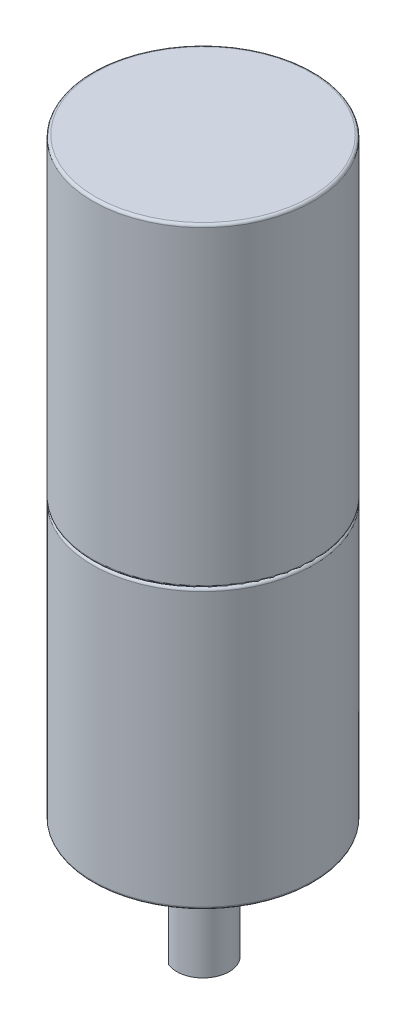
ISO-10303-21;
HEADER;
FILE_DESCRIPTION(('STEP AP214'),'2;1');
FILE_NAME('part.step','',(''),(''),'','','');
FILE_SCHEMA(('AUTOMOTIVE_DESIGN { 1 0 10303 214 1 1 1 1 }'));
ENDSEC;
DATA;
#1=APPLICATION_CONTEXT('core data for automotive mechanical design processes');
#2=APPLICATION_PROTOCOL_DEFINITION('international standard','automotive_design',2000,#1);
#3=PRODUCT_CONTEXT('',#1,'mechanical');
#4=PRODUCT('Part','Part','',(#3));
#5=PRODUCT_RELATED_PRODUCT_CATEGORY('part','',(#4));
#6=PRODUCT_DEFINITION_FORMATION('','',#4);
#7=PRODUCT_DEFINITION_CONTEXT('part definition',#1,'design');
#8=PRODUCT_DEFINITION('design','',#6,#7);
#9=PRODUCT_DEFINITION_SHAPE('','',#8);
#10=(LENGTH_UNIT() NAMED_UNIT(*) SI_UNIT(.MILLI.,.METRE.));
#11=(NAMED_UNIT(*) PLANE_ANGLE_UNIT() SI_UNIT($,.RADIAN.));
#12=(NAMED_UNIT(*) SI_UNIT($,.STERADIAN.) SOLID_ANGLE_UNIT());
#13=UNCERTAINTY_MEASURE_WITH_UNIT(LENGTH_MEASURE(1.E-05),#10,'distance_accuracy_value','');
#14=(GEOMETRIC_REPRESENTATION_CONTEXT(3) GLOBAL_UNCERTAINTY_ASSIGNED_CONTEXT((#13)) GLOBAL_UNIT_ASSIGNED_CONTEXT((#10,
#11,#12)) REPRESENTATION_CONTEXT('',''));
#15=CARTESIAN_POINT('',(0.,0.,0.));
#16=DIRECTION('',(0.,0.,1.));
#17=DIRECTION('',(1.,0.,0.));
#18=AXIS2_PLACEMENT_3D('',#15,#16,#17);
#19=CARTESIAN_POINT('',(0.,-53.,0.));
#20=DIRECTION('',(0.,-1.,0.));
#21=DIRECTION('',(0.,0.,-1.));
#22=AXIS2_PLACEMENT_3D('',#19,#20,#21);
#23=PLANE('',#22);
#24=CARTESIAN_POINT('',(-17.5,-53.,0.));
#25=DIRECTION('',(0.,-1.,0.));
#26=DIRECTION('',(0.,0.,-1.));
#27=AXIS2_PLACEMENT_3D('',#24,#25,#26);
#28=CIRCLE('',#27,2.);
#29=CARTESIAN_POINT('',(-17.5,-53.,-2.));
#30=VERTEX_POINT('',#29);
#31=EDGE_CURVE('E386',#30,#30,#28,.T.);
#32=ORIENTED_EDGE('',*,*,#31,.F.);
#33=EDGE_LOOP('',(#32));
#34=FACE_BOUND('',#33,.T.);
#35=CARTESIAN_POINT('',(0.,-53.,17.5));
#36=DIRECTION('',(0.,-1.,0.));
#37=DIRECTION('',(0.,0.,-1.));
#38=AXIS2_PLACEMENT_3D('',#35,#36,#37);
#39=CIRCLE('',#38,2.);
#40=CARTESIAN_POINT('',(0.,-53.,15.5));
#41=VERTEX_POINT('',#40);
#42=EDGE_CURVE('E394',#41,#41,#39,.T.);
#43=ORIENTED_EDGE('',*,*,#42,.F.);
#44=EDGE_LOOP('',(#43));
#45=FACE_BOUND('',#44,.T.);
#46=CARTESIAN_POINT('',(17.5,-53.,0.));
#47=DIRECTION('',(0.,-1.,0.));
#48=DIRECTION('',(0.,0.,-1.));
#49=AXIS2_PLACEMENT_3D('',#46,#47,#48);
#50=CIRCLE('',#49,2.);
#51=CARTESIAN_POINT('',(17.5,-53.,-2.));
#52=VERTEX_POINT('',#51);
#53=EDGE_CURVE('E400',#52,#52,#50,.T.);
#54=ORIENTED_EDGE('',*,*,#53,.F.);
#55=EDGE_LOOP('',(#54));
#56=FACE_BOUND('',#55,.T.);
#57=CARTESIAN_POINT('',(0.,-53.,-17.5));
#58=DIRECTION('',(0.,-1.,0.));
#59=DIRECTION('',(0.,0.,-1.));
#60=AXIS2_PLACEMENT_3D('',#57,#58,#59);
#61=CIRCLE('',#60,2.);
#62=CARTESIAN_POINT('',(0.,-53.,-19.5));
#63=VERTEX_POINT('',#62);
#64=EDGE_CURVE('E406',#63,#63,#61,.T.);
#65=ORIENTED_EDGE('',*,*,#64,.F.);
#66=EDGE_LOOP('',(#65));
#67=FACE_BOUND('',#66,.T.);
#68=CARTESIAN_POINT('',(0.,-53.,0.));
#69=DIRECTION('',(0.,-1.,0.));
#70=DIRECTION('',(0.,0.,-1.));
#71=AXIS2_PLACEMENT_3D('',#68,#69,#70);
#72=CIRCLE('',#71,20.5);
#73=CARTESIAN_POINT('',(0.,-53.,-20.5));
#74=VERTEX_POINT('',#73);
#75=EDGE_CURVE('E155',#74,#74,#72,.T.);
#76=ORIENTED_EDGE('',*,*,#75,.T.);
#77=EDGE_LOOP('',(#76));
#78=FACE_BOUND('',#77,.T.);
#79=DIRECTION('',(0.,0.,1.));
#80=VECTOR('',#79,1.);
#81=CARTESIAN_POINT('',(11.5,-53.,-4.89897948556636));
#82=LINE('',#81,#80);
#83=CARTESIAN_POINT('',(11.5,-53.,-4.89897948556636));
#84=VERTEX_POINT('',#83);
#85=CARTESIAN_POINT('',(11.5,-53.,4.89897948556636));
#86=VERTEX_POINT('',#85);
#87=EDGE_CURVE('E130',#84,#86,#82,.T.);
#88=ORIENTED_EDGE('',*,*,#87,.F.);
#89=CARTESIAN_POINT('',(0.,-53.,0.));
#90=DIRECTION('',(0.,-1.,0.));
#91=DIRECTION('',(0.,0.,-1.));
#92=AXIS2_PLACEMENT_3D('',#89,#90,#91);
#93=CIRCLE('',#92,12.5);
#94=CARTESIAN_POINT('',(-11.5,-53.,-4.89897948556636));
#95=VERTEX_POINT('',#94);
#96=EDGE_CURVE('E115',#95,#84,#93,.T.);
#97=ORIENTED_EDGE('',*,*,#96,.F.);
#98=DIRECTION('',(0.,0.,-1.));
#99=VECTOR('',#98,1.);
#100=CARTESIAN_POINT('',(-11.5,-53.,-4.89897948556636));
#101=LINE('',#100,#99);
#102=CARTESIAN_POINT('',(-11.5,-53.,4.89897948556636));
#103=VERTEX_POINT('',#102);
#104=EDGE_CURVE('E121',#103,#95,#101,.T.);
#105=ORIENTED_EDGE('',*,*,#104,.F.);
#106=CARTESIAN_POINT('',(0.,-53.,0.));
#107=DIRECTION('',(0.,-1.,0.));
#108=DIRECTION('',(0.,0.,-1.));
#109=AXIS2_PLACEMENT_3D('',#106,#107,#108);
#110=CIRCLE('',#109,12.5);
#111=EDGE_CURVE('E132',#86,#103,#110,.T.);
#112=ORIENTED_EDGE('',*,*,#111,.F.);
#113=EDGE_LOOP('',(#88,#97,#105,#112));
#114=FACE_BOUND('',#113,.T.);
#115=ADVANCED_FACE('F40',(#34,#45,#56,#67,#78,#114),#23,.T.);
#116=CARTESIAN_POINT('',(0.,60.,0.));
#117=DIRECTION('',(0.,-1.,0.));
#118=DIRECTION('',(0.,0.,-1.));
#119=AXIS2_PLACEMENT_3D('',#116,#117,#118);
#120=CYLINDRICAL_SURFACE('',#119,21.);
#121=CARTESIAN_POINT('',(0.,59.5,0.));
#122=DIRECTION('',(0.,1.,0.));
#123=DIRECTION('',(0.,0.,1.));
#124=AXIS2_PLACEMENT_3D('',#121,#122,#123);
#125=CIRCLE('',#124,21.);
#126=CARTESIAN_POINT('',(0.,59.5,21.));
#127=VERTEX_POINT('',#126);
#128=EDGE_CURVE('E149',#127,#127,#125,.F.);
#129=ORIENTED_EDGE('',*,*,#128,.T.);
#130=EDGE_LOOP('',(#129));
#131=FACE_BOUND('',#130,.T.);
#132=CARTESIAN_POINT('',(0.,0.5,0.));
#133=DIRECTION('',(0.,1.,0.));
#134=DIRECTION('',(0.,0.,1.));
#135=AXIS2_PLACEMENT_3D('',#132,#133,#134);
#136=CIRCLE('',#135,21.);
#137=CARTESIAN_POINT('',(0.,0.5,21.));
#138=VERTEX_POINT('',#137);
#139=EDGE_CURVE('E146',#138,#138,#136,.T.);
#140=ORIENTED_EDGE('',*,*,#139,.T.);
#141=EDGE_LOOP('',(#140));
#142=FACE_BOUND('',#141,.T.);
#143=ADVANCED_FACE('F173',(#131,#142),#120,.T.);
#144=CARTESIAN_POINT('',(0.,60.,0.));
#145=DIRECTION('',(0.,1.,0.));
#146=DIRECTION('',(0.,0.,1.));
#147=AXIS2_PLACEMENT_3D('',#144,#145,#146);
#148=PLANE('',#147);
#149=CARTESIAN_POINT('',(0.,60.,0.));
#150=DIRECTION('',(0.,1.,0.));
#151=DIRECTION('',(0.,0.,1.));
#152=AXIS2_PLACEMENT_3D('',#149,#150,#151);
#153=CIRCLE('',#152,20.5);
#154=CARTESIAN_POINT('',(0.,60.,20.5));
#155=VERTEX_POINT('',#154);
#156=EDGE_CURVE('E143',#155,#155,#153,.T.);
#157=ORIENTED_EDGE('',*,*,#156,.T.);
#158=EDGE_LOOP('',(#157));
#159=FACE_BOUND('',#158,.T.);
#160=ADVANCED_FACE('F212',(#159),#148,.T.);
#161=CARTESIAN_POINT('',(0.,59.5,0.));
#162=DIRECTION('',(0.,1.,0.));
#163=DIRECTION('',(0.,0.,1.));
#164=AXIS2_PLACEMENT_3D('',#161,#162,#163);
#165=TOROIDAL_SURFACE('',#164,20.5,0.5);
#166=ORIENTED_EDGE('',*,*,#128,.F.);
#167=EDGE_LOOP('',(#166));
#168=FACE_BOUND('',#167,.T.);
#169=ORIENTED_EDGE('',*,*,#156,.F.);
#170=EDGE_LOOP('',(#169));
#171=FACE_BOUND('',#170,.T.);
#172=ADVANCED_FACE('F215',(#168,#171),#165,.T.);
#173=CARTESIAN_POINT('',(0.,0.5,0.));
#174=DIRECTION('',(0.,1.,0.));
#175=DIRECTION('',(0.,0.,1.));
#176=AXIS2_PLACEMENT_3D('',#173,#174,#175);
#177=TOROIDAL_SURFACE('',#176,20.5,0.5);
#178=CARTESIAN_POINT('',(0.,0.,0.));
#179=DIRECTION('',(0.,1.,0.));
#180=DIRECTION('',(0.,0.,1.));
#181=AXIS2_PLACEMENT_3D('',#178,#179,#180);
#182=CIRCLE('',#181,20.5);
#183=CARTESIAN_POINT('',(0.,0.,20.5));
#184=VERTEX_POINT('',#183);
#185=EDGE_CURVE('E152',#184,#184,#182,.F.);
#186=ORIENTED_EDGE('',*,*,#185,.F.);
#187=EDGE_LOOP('',(#186));
#188=FACE_BOUND('',#187,.T.);
#189=ORIENTED_EDGE('',*,*,#139,.F.);
#190=EDGE_LOOP('',(#189));
#191=FACE_BOUND('',#190,.T.);
#192=ADVANCED_FACE('F211',(#188,#191),#177,.T.);
#193=CARTESIAN_POINT('',(0.,-53.,0.));
#194=DIRECTION('',(0.,1.,0.));
#195=DIRECTION('',(0.,0.,1.));
#196=AXIS2_PLACEMENT_3D('',#193,#194,#195);
#197=CYLINDRICAL_SURFACE('',#196,21.);
#198=CARTESIAN_POINT('',(0.,-52.5,0.));
#199=DIRECTION('',(0.,-1.,0.));
#200=DIRECTION('',(0.,0.,-1.));
#201=AXIS2_PLACEMENT_3D('',#198,#199,#200);
#202=CIRCLE('',#201,21.);
#203=CARTESIAN_POINT('',(0.,-52.5,-21.));
#204=VERTEX_POINT('',#203);
#205=EDGE_CURVE('E44',#204,#204,#202,.F.);
#206=ORIENTED_EDGE('',*,*,#205,.T.);
#207=EDGE_LOOP('',(#206));
#208=FACE_BOUND('',#207,.T.);
#209=CARTESIAN_POINT('',(0.,-0.5,0.));
#210=DIRECTION('',(0.,-1.,0.));
#211=DIRECTION('',(0.,0.,-1.));
#212=AXIS2_PLACEMENT_3D('',#209,#210,#211);
#213=CIRCLE('',#212,21.);
#214=CARTESIAN_POINT('',(0.,-0.5,-21.));
#215=VERTEX_POINT('',#214);
#216=EDGE_CURVE('E157',#215,#215,#213,.T.);
#217=ORIENTED_EDGE('',*,*,#216,.T.);
#218=EDGE_LOOP('',(#217));
#219=FACE_BOUND('',#218,.T.);
#220=ADVANCED_FACE('F164',(#208,#219),#197,.T.);
#221=CARTESIAN_POINT('',(0.,-52.5,0.));
#222=DIRECTION('',(0.,-1.,0.));
#223=DIRECTION('',(0.,0.,-1.));
#224=AXIS2_PLACEMENT_3D('',#221,#222,#223);
#225=TOROIDAL_SURFACE('',#224,20.5,0.5);
#226=ORIENTED_EDGE('',*,*,#205,.F.);
#227=EDGE_LOOP('',(#226));
#228=FACE_BOUND('',#227,.T.);
#229=ORIENTED_EDGE('',*,*,#75,.F.);
#230=EDGE_LOOP('',(#229));
#231=FACE_BOUND('',#230,.T.);
#232=ADVANCED_FACE('F166',(#228,#231),#225,.T.);
#233=CARTESIAN_POINT('',(0.,-0.5,0.));
#234=DIRECTION('',(0.,-1.,0.));
#235=DIRECTION('',(0.,0.,-1.));
#236=AXIS2_PLACEMENT_3D('',#233,#234,#235);
#237=TOROIDAL_SURFACE('',#236,20.5,0.5);
#238=ORIENTED_EDGE('',*,*,#185,.T.);
#239=EDGE_LOOP('',(#238));
#240=FACE_BOUND('',#239,.T.);
#241=ORIENTED_EDGE('',*,*,#216,.F.);
#242=EDGE_LOOP('',(#241));
#243=FACE_BOUND('',#242,.T.);
#244=ADVANCED_FACE('F42',(#240,#243),#237,.T.);
#245=CARTESIAN_POINT('',(0.,-55.,0.));
#246=DIRECTION('',(0.,1.,0.));
#247=DIRECTION('',(0.,0.,1.));
#248=AXIS2_PLACEMENT_3D('',#245,#246,#247);
#249=CYLINDRICAL_SURFACE('',#248,12.5);
#250=ORIENTED_EDGE('',*,*,#96,.T.);
#251=DIRECTION('',(0.,1.,0.));
#252=VECTOR('',#251,1.);
#253=CARTESIAN_POINT('',(11.5,-55.,-4.89897948556636));
#254=LINE('',#253,#252);
#255=CARTESIAN_POINT('',(11.5,-55.,-4.89897948556636));
#256=VERTEX_POINT('',#255);
#257=EDGE_CURVE('E141',#256,#84,#254,.T.);
#258=ORIENTED_EDGE('',*,*,#257,.F.);
#259=CARTESIAN_POINT('',(0.,-55.,0.));
#260=DIRECTION('',(0.,-1.,0.));
#261=DIRECTION('',(0.,0.,-1.));
#262=AXIS2_PLACEMENT_3D('',#259,#260,#261);
#263=CIRCLE('',#262,12.5);
#264=CARTESIAN_POINT('',(-11.5,-55.,-4.89897948556636));
#265=VERTEX_POINT('',#264);
#266=EDGE_CURVE('E117',#265,#256,#263,.T.);
#267=ORIENTED_EDGE('',*,*,#266,.F.);
#268=DIRECTION('',(0.,1.,0.));
#269=VECTOR('',#268,1.);
#270=CARTESIAN_POINT('',(-11.5,-55.,-4.89897948556636));
#271=LINE('',#270,#269);
#272=EDGE_CURVE('E127',#265,#95,#271,.T.);
#273=ORIENTED_EDGE('',*,*,#272,.T.);
#274=EDGE_LOOP('',(#250,#258,#267,#273));
#275=FACE_BOUND('',#274,.T.);
#276=ADVANCED_FACE('F192',(#275),#249,.T.);
#277=CARTESIAN_POINT('',(11.5,-55.,-4.89897948556636));
#278=DIRECTION('',(-1.,0.,0.));
#279=DIRECTION('',(0.,0.,1.));
#280=AXIS2_PLACEMENT_3D('',#277,#278,#279);
#281=PLANE('',#280);
#282=ORIENTED_EDGE('',*,*,#87,.T.);
#283=DIRECTION('',(0.,1.,0.));
#284=VECTOR('',#283,1.);
#285=CARTESIAN_POINT('',(11.5,-55.,4.89897948556636));
#286=LINE('',#285,#284);
#287=CARTESIAN_POINT('',(11.5,-55.,4.89897948556636));
#288=VERTEX_POINT('',#287);
#289=EDGE_CURVE('E138',#288,#86,#286,.T.);
#290=ORIENTED_EDGE('',*,*,#289,.F.);
#291=DIRECTION('',(0.,0.,1.));
#292=VECTOR('',#291,1.);
#293=CARTESIAN_POINT('',(11.5,-55.,-4.89897948556636));
#294=LINE('',#293,#292);
#295=EDGE_CURVE('E120',#256,#288,#294,.T.);
#296=ORIENTED_EDGE('',*,*,#295,.F.);
#297=ORIENTED_EDGE('',*,*,#257,.T.);
#298=EDGE_LOOP('',(#282,#290,#296,#297));
#299=FACE_BOUND('',#298,.T.);
#300=ADVANCED_FACE('F182',(#299),#281,.F.);
#301=CARTESIAN_POINT('',(0.,-55.,0.));
#302=DIRECTION('',(0.,1.,0.));
#303=DIRECTION('',(0.,0.,1.));
#304=AXIS2_PLACEMENT_3D('',#301,#302,#303);
#305=CYLINDRICAL_SURFACE('',#304,12.5);
#306=ORIENTED_EDGE('',*,*,#111,.T.);
#307=DIRECTION('',(0.,1.,0.));
#308=VECTOR('',#307,1.);
#309=CARTESIAN_POINT('',(-11.5,-55.,4.89897948556636));
#310=LINE('',#309,#308);
#311=CARTESIAN_POINT('',(-11.5,-55.,4.89897948556636));
#312=VERTEX_POINT('',#311);
#313=EDGE_CURVE('E64',#312,#103,#310,.T.);
#314=ORIENTED_EDGE('',*,*,#313,.F.);
#315=CARTESIAN_POINT('',(0.,-55.,0.));
#316=DIRECTION('',(0.,-1.,0.));
#317=DIRECTION('',(0.,0.,-1.));
#318=AXIS2_PLACEMENT_3D('',#315,#316,#317);
#319=CIRCLE('',#318,12.5);
#320=EDGE_CURVE('E123',#288,#312,#319,.T.);
#321=ORIENTED_EDGE('',*,*,#320,.F.);
#322=ORIENTED_EDGE('',*,*,#289,.T.);
#323=EDGE_LOOP('',(#306,#314,#321,#322));
#324=FACE_BOUND('',#323,.T.);
#325=ADVANCED_FACE('F186',(#324),#305,.T.);
#326=CARTESIAN_POINT('',(-11.5,-55.,-4.89897948556636));
#327=DIRECTION('',(1.,0.,0.));
#328=DIRECTION('',(0.,0.,-1.));
#329=AXIS2_PLACEMENT_3D('',#326,#327,#328);
#330=PLANE('',#329);
#331=ORIENTED_EDGE('',*,*,#104,.T.);
#332=ORIENTED_EDGE('',*,*,#272,.F.);
#333=DIRECTION('',(0.,0.,-1.));
#334=VECTOR('',#333,1.);
#335=CARTESIAN_POINT('',(-11.5,-55.,-4.89897948556636));
#336=LINE('',#335,#334);
#337=EDGE_CURVE('E125',#312,#265,#336,.T.);
#338=ORIENTED_EDGE('',*,*,#337,.F.);
#339=ORIENTED_EDGE('',*,*,#313,.T.);
#340=EDGE_LOOP('',(#331,#332,#338,#339));
#341=FACE_BOUND('',#340,.T.);
#342=ADVANCED_FACE('F193',(#341),#330,.F.);
#343=CARTESIAN_POINT('',(0.,-55.,0.));
#344=DIRECTION('',(0.,-1.,0.));
#345=DIRECTION('',(0.,0.,-1.));
#346=AXIS2_PLACEMENT_3D('',#343,#344,#345);
#347=PLANE('',#346);
#348=CARTESIAN_POINT('',(0.,-55.,0.));
#349=DIRECTION('',(0.,-1.,0.));
#350=DIRECTION('',(0.,0.,-1.));
#351=AXIS2_PLACEMENT_3D('',#348,#349,#350);
#352=CIRCLE('',#351,5.);
#353=CARTESIAN_POINT('',(0.,-55.,-5.));
#354=VERTEX_POINT('',#353);
#355=EDGE_CURVE('E11',#354,#354,#352,.T.);
#356=ORIENTED_EDGE('',*,*,#355,.F.);
#357=EDGE_LOOP('',(#356));
#358=FACE_BOUND('',#357,.T.);
#359=ORIENTED_EDGE('',*,*,#266,.T.);
#360=ORIENTED_EDGE('',*,*,#295,.T.);
#361=ORIENTED_EDGE('',*,*,#320,.T.);
#362=ORIENTED_EDGE('',*,*,#337,.T.);
#363=EDGE_LOOP('',(#359,#360,#361,#362));
#364=FACE_BOUND('',#363,.T.);
#365=ADVANCED_FACE('F188',(#358,#364),#347,.T.);
#366=CARTESIAN_POINT('',(0.,-75.5,0.));
#367=DIRECTION('',(0.,1.,0.));
#368=DIRECTION('',(0.,0.,1.));
#369=AXIS2_PLACEMENT_3D('',#366,#367,#368);
#370=CYLINDRICAL_SURFACE('',#369,5.);
#371=CARTESIAN_POINT('',(0.,-75.5,0.));
#372=DIRECTION('',(0.,-1.,0.));
#373=DIRECTION('',(0.,0.,-1.));
#374=AXIS2_PLACEMENT_3D('',#371,#372,#373);
#375=CIRCLE('',#374,5.);
#376=CARTESIAN_POINT('',(-2.,-75.5,-4.58257569495584));
#377=VERTEX_POINT('',#376);
#378=CARTESIAN_POINT('',(-2.,-75.5,4.58257569495584));
#379=VERTEX_POINT('',#378);
#380=EDGE_CURVE('E110',#377,#379,#375,.T.);
#381=ORIENTED_EDGE('',*,*,#380,.F.);
#382=DIRECTION('',(0.,-1.,0.));
#383=VECTOR('',#382,1.);
#384=CARTESIAN_POINT('',(-2.,-63.5,-4.58257569495584));
#385=LINE('',#384,#383);
#386=CARTESIAN_POINT('',(-2.,-63.5,-4.58257569495584));
#387=VERTEX_POINT('',#386);
#388=EDGE_CURVE('E56',#387,#377,#385,.T.);
#389=ORIENTED_EDGE('',*,*,#388,.F.);
#390=CARTESIAN_POINT('',(0.,-63.5,0.));
#391=DIRECTION('',(0.,-1.,0.));
#392=DIRECTION('',(0.,0.,-1.));
#393=AXIS2_PLACEMENT_3D('',#390,#391,#392);
#394=CIRCLE('',#393,5.);
#395=CARTESIAN_POINT('',(-2.,-63.5,4.58257569495584));
#396=VERTEX_POINT('',#395);
#397=EDGE_CURVE('E96',#396,#387,#394,.T.);
#398=ORIENTED_EDGE('',*,*,#397,.F.);
#399=DIRECTION('',(0.,-1.,0.));
#400=VECTOR('',#399,1.);
#401=CARTESIAN_POINT('',(-2.,-63.5,4.58257569495584));
#402=LINE('',#401,#400);
#403=EDGE_CURVE('E104',#396,#379,#402,.T.);
#404=ORIENTED_EDGE('',*,*,#403,.T.);
#405=EDGE_LOOP('',(#381,#389,#398,#404));
#406=FACE_BOUND('',#405,.T.);
#407=ORIENTED_EDGE('',*,*,#355,.T.);
#408=EDGE_LOOP('',(#407));
#409=FACE_BOUND('',#408,.T.);
#410=ADVANCED_FACE('F107',(#406,#409),#370,.T.);
#411=CARTESIAN_POINT('',(0.,-75.5,0.));
#412=DIRECTION('',(0.,-1.,0.));
#413=DIRECTION('',(0.,0.,-1.));
#414=AXIS2_PLACEMENT_3D('',#411,#412,#413);
#415=PLANE('',#414);
#416=DIRECTION('',(0.,0.,1.));
#417=VECTOR('',#416,1.);
#418=CARTESIAN_POINT('',(-2.,-75.5,4.58257569495584));
#419=LINE('',#418,#417);
#420=EDGE_CURVE('E101',#377,#379,#419,.T.);
#421=ORIENTED_EDGE('',*,*,#420,.F.);
#422=ORIENTED_EDGE('',*,*,#380,.T.);
#423=EDGE_LOOP('',(#421,#422));
#424=FACE_BOUND('',#423,.T.);
#425=ADVANCED_FACE('F269',(#424),#415,.T.);
#426=CARTESIAN_POINT('',(-2.,-63.5,4.58257569495584));
#427=DIRECTION('',(1.,0.,0.));
#428=DIRECTION('',(0.,0.,-1.));
#429=AXIS2_PLACEMENT_3D('',#426,#427,#428);
#430=PLANE('',#429);
#431=ORIENTED_EDGE('',*,*,#420,.T.);
#432=ORIENTED_EDGE('',*,*,#403,.F.);
#433=DIRECTION('',(0.,0.,1.));
#434=VECTOR('',#433,1.);
#435=CARTESIAN_POINT('',(-2.,-63.5,4.58257569495584));
#436=LINE('',#435,#434);
#437=EDGE_CURVE('E98',#387,#396,#436,.T.);
#438=ORIENTED_EDGE('',*,*,#437,.F.);
#439=ORIENTED_EDGE('',*,*,#388,.T.);
#440=EDGE_LOOP('',(#431,#432,#438,#439));
#441=FACE_BOUND('',#440,.T.);
#442=ADVANCED_FACE('F103',(#441),#430,.F.);
#443=CARTESIAN_POINT('',(0.,-63.5,0.));
#444=DIRECTION('',(0.,-1.,0.));
#445=DIRECTION('',(0.,0.,-1.));
#446=AXIS2_PLACEMENT_3D('',#443,#444,#445);
#447=PLANE('',#446);
#448=ORIENTED_EDGE('',*,*,#397,.T.);
#449=ORIENTED_EDGE('',*,*,#437,.T.);
#450=EDGE_LOOP('',(#448,#449));
#451=FACE_BOUND('',#450,.T.);
#452=ADVANCED_FACE('F97',(#451),#447,.T.);
#453=CARTESIAN_POINT('',(0.,-48.,-17.5));
#454=DIRECTION('',(0.,-1.,0.));
#455=DIRECTION('',(0.,0.,-1.));
#456=AXIS2_PLACEMENT_3D('',#453,#454,#455);
#457=CYLINDRICAL_SURFACE('',#456,2.);
#458=CARTESIAN_POINT('',(0.,-48.,-17.5));
#459=DIRECTION('',(0.,-1.,0.));
#460=DIRECTION('',(0.,0.,-1.));
#461=AXIS2_PLACEMENT_3D('',#458,#459,#460);
#462=CIRCLE('',#461,2.);
#463=CARTESIAN_POINT('',(0.,-48.,-19.5));
#464=VERTEX_POINT('',#463);
#465=EDGE_CURVE('E403',#464,#464,#462,.T.);
#466=ORIENTED_EDGE('',*,*,#465,.F.);
#467=EDGE_LOOP('',(#466));
#468=FACE_BOUND('',#467,.T.);
#469=ORIENTED_EDGE('',*,*,#64,.T.);
#470=EDGE_LOOP('',(#469));
#471=FACE_BOUND('',#470,.T.);
#472=ADVANCED_FACE('F294',(#468,#471),#457,.F.);
#473=CARTESIAN_POINT('',(0.,-48.,-17.5));
#474=DIRECTION('',(0.,-1.,0.));
#475=DIRECTION('',(0.,0.,-1.));
#476=AXIS2_PLACEMENT_3D('',#473,#474,#475);
#477=PLANE('',#476);
#478=ORIENTED_EDGE('',*,*,#465,.T.);
#479=EDGE_LOOP('',(#478));
#480=FACE_BOUND('',#479,.T.);
#481=ADVANCED_FACE('F309',(#480),#477,.T.);
#482=CARTESIAN_POINT('',(17.5,-48.,0.));
#483=DIRECTION('',(0.,-1.,0.));
#484=DIRECTION('',(0.,0.,-1.));
#485=AXIS2_PLACEMENT_3D('',#482,#483,#484);
#486=CYLINDRICAL_SURFACE('',#485,2.);
#487=CARTESIAN_POINT('',(17.5,-48.,0.));
#488=DIRECTION('',(0.,-1.,0.));
#489=DIRECTION('',(0.,0.,-1.));
#490=AXIS2_PLACEMENT_3D('',#487,#488,#489);
#491=CIRCLE('',#490,2.);
#492=CARTESIAN_POINT('',(17.5,-48.,-2.));
#493=VERTEX_POINT('',#492);
#494=EDGE_CURVE('E397',#493,#493,#491,.T.);
#495=ORIENTED_EDGE('',*,*,#494,.F.);
#496=EDGE_LOOP('',(#495));
#497=FACE_BOUND('',#496,.T.);
#498=ORIENTED_EDGE('',*,*,#53,.T.);
#499=EDGE_LOOP('',(#498));
#500=FACE_BOUND('',#499,.T.);
#501=ADVANCED_FACE('F319',(#497,#500),#486,.F.);
#502=CARTESIAN_POINT('',(17.5,-48.,0.));
#503=DIRECTION('',(0.,-1.,0.));
#504=DIRECTION('',(0.,0.,-1.));
#505=AXIS2_PLACEMENT_3D('',#502,#503,#504);
#506=PLANE('',#505);
#507=ORIENTED_EDGE('',*,*,#494,.T.);
#508=EDGE_LOOP('',(#507));
#509=FACE_BOUND('',#508,.T.);
#510=ADVANCED_FACE('F329',(#509),#506,.T.);
#511=CARTESIAN_POINT('',(0.,-48.,17.5));
#512=DIRECTION('',(0.,-1.,0.));
#513=DIRECTION('',(0.,0.,-1.));
#514=AXIS2_PLACEMENT_3D('',#511,#512,#513);
#515=CYLINDRICAL_SURFACE('',#514,2.);
#516=CARTESIAN_POINT('',(0.,-48.,17.5));
#517=DIRECTION('',(0.,-1.,0.));
#518=DIRECTION('',(0.,0.,-1.));
#519=AXIS2_PLACEMENT_3D('',#516,#517,#518);
#520=CIRCLE('',#519,2.);
#521=CARTESIAN_POINT('',(0.,-48.,15.5));
#522=VERTEX_POINT('',#521);
#523=EDGE_CURVE('E389',#522,#522,#520,.T.);
#524=ORIENTED_EDGE('',*,*,#523,.F.);
#525=EDGE_LOOP('',(#524));
#526=FACE_BOUND('',#525,.T.);
#527=ORIENTED_EDGE('',*,*,#42,.T.);
#528=EDGE_LOOP('',(#527));
#529=FACE_BOUND('',#528,.T.);
#530=ADVANCED_FACE('F339',(#526,#529),#515,.F.);
#531=CARTESIAN_POINT('',(0.,-48.,17.5));
#532=DIRECTION('',(0.,-1.,0.));
#533=DIRECTION('',(0.,0.,-1.));
#534=AXIS2_PLACEMENT_3D('',#531,#532,#533);
#535=PLANE('',#534);
#536=ORIENTED_EDGE('',*,*,#523,.T.);
#537=EDGE_LOOP('',(#536));
#538=FACE_BOUND('',#537,.T.);
#539=ADVANCED_FACE('F349',(#538),#535,.T.);
#540=CARTESIAN_POINT('',(-17.5,-48.,0.));
#541=DIRECTION('',(0.,-1.,0.));
#542=DIRECTION('',(0.,0.,-1.));
#543=AXIS2_PLACEMENT_3D('',#540,#541,#542);
#544=CYLINDRICAL_SURFACE('',#543,2.);
#545=CARTESIAN_POINT('',(-17.5,-48.,0.));
#546=DIRECTION('',(0.,-1.,0.));
#547=DIRECTION('',(0.,0.,-1.));
#548=AXIS2_PLACEMENT_3D('',#545,#546,#547);
#549=CIRCLE('',#548,2.);
#550=CARTESIAN_POINT('',(-17.5,-48.,-2.));
#551=VERTEX_POINT('',#550);
#552=EDGE_CURVE('E385',#551,#551,#549,.T.);
#553=ORIENTED_EDGE('',*,*,#552,.F.);
#554=EDGE_LOOP('',(#553));
#555=FACE_BOUND('',#554,.T.);
#556=ORIENTED_EDGE('',*,*,#31,.T.);
#557=EDGE_LOOP('',(#556));
#558=FACE_BOUND('',#557,.T.);
#559=ADVANCED_FACE('F359',(#555,#558),#544,.F.);
#560=CARTESIAN_POINT('',(-17.5,-48.,0.));
#561=DIRECTION('',(0.,-1.,0.));
#562=DIRECTION('',(0.,0.,-1.));
#563=AXIS2_PLACEMENT_3D('',#560,#561,#562);
#564=PLANE('',#563);
#565=ORIENTED_EDGE('',*,*,#552,.T.);
#566=EDGE_LOOP('',(#565));
#567=FACE_BOUND('',#566,.T.);
#568=ADVANCED_FACE('F369',(#567),#564,.T.);
#569=CLOSED_SHELL('',(#115,#143,#160,#172,#192,#220,#232,#244,#276,#300,#325,#342,#365,#410,
#425,#442,#452,#472,#481,#501,#510,#530,#539,#559,#568));
#570=MANIFOLD_SOLID_BREP('B2',#569);
#571=ADVANCED_BREP_SHAPE_REPRESENTATION('',(#18,#570),#14);
#572=SHAPE_DEFINITION_REPRESENTATION(#9,#571);
ENDSEC;
END-ISO-10303-21;
